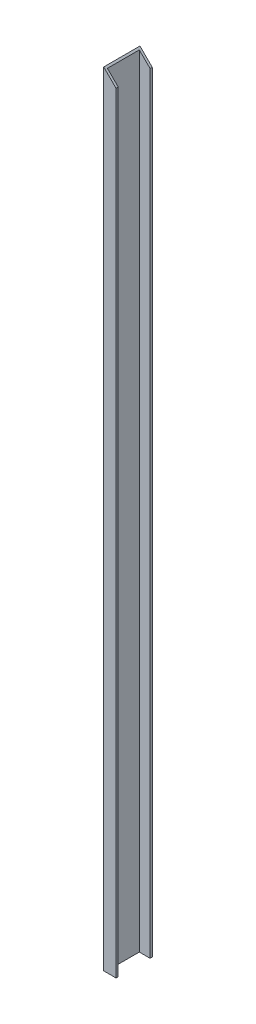
ISO-10303-21;
HEADER;
FILE_DESCRIPTION(('STEP AP214'),'2;1');
FILE_NAME('part.step','',(''),(''),'','','');
FILE_SCHEMA(('AUTOMOTIVE_DESIGN { 1 0 10303 214 1 1 1 1 }'));
ENDSEC;
DATA;
#1=APPLICATION_CONTEXT('core data for automotive mechanical design processes');
#2=APPLICATION_PROTOCOL_DEFINITION('international standard','automotive_design',2000,#1);
#3=PRODUCT_CONTEXT('',#1,'mechanical');
#4=PRODUCT('Part','Part','',(#3));
#5=PRODUCT_RELATED_PRODUCT_CATEGORY('part','',(#4));
#6=PRODUCT_DEFINITION_FORMATION('','',#4);
#7=PRODUCT_DEFINITION_CONTEXT('part definition',#1,'design');
#8=PRODUCT_DEFINITION('design','',#6,#7);
#9=PRODUCT_DEFINITION_SHAPE('','',#8);
#10=(LENGTH_UNIT() NAMED_UNIT(*) SI_UNIT(.MILLI.,.METRE.));
#11=(NAMED_UNIT(*) PLANE_ANGLE_UNIT() SI_UNIT($,.RADIAN.));
#12=(NAMED_UNIT(*) SI_UNIT($,.STERADIAN.) SOLID_ANGLE_UNIT());
#13=UNCERTAINTY_MEASURE_WITH_UNIT(LENGTH_MEASURE(1.E-05),#10,'distance_accuracy_value','');
#14=(GEOMETRIC_REPRESENTATION_CONTEXT(3) GLOBAL_UNCERTAINTY_ASSIGNED_CONTEXT((#13)) GLOBAL_UNIT_ASSIGNED_CONTEXT((#10,
#11,#12)) REPRESENTATION_CONTEXT('',''));
#15=CARTESIAN_POINT('',(0.,0.,0.));
#16=DIRECTION('',(0.,0.,1.));
#17=DIRECTION('',(1.,0.,0.));
#18=AXIS2_PLACEMENT_3D('',#15,#16,#17);
#19=CARTESIAN_POINT('',(0.,2743.2,-127.));
#20=DIRECTION('',(1.,0.,0.));
#21=DIRECTION('',(0.,0.,-1.));
#22=AXIS2_PLACEMENT_3D('',#19,#20,#21);
#23=PLANE('',#22);
#24=DIRECTION('',(0.,0.,1.));
#25=VECTOR('',#24,1.);
#26=CARTESIAN_POINT('',(0.,0.,-127.));
#27=LINE('',#26,#25);
#28=CARTESIAN_POINT('',(0.,0.,-127.));
#29=VERTEX_POINT('',#28);
#30=CARTESIAN_POINT('',(0.,0.,0.));
#31=VERTEX_POINT('',#30);
#32=EDGE_CURVE('E99',#29,#31,#27,.T.);
#33=ORIENTED_EDGE('',*,*,#32,.T.);
#34=DIRECTION('',(0.,-1.,0.));
#35=VECTOR('',#34,1.);
#36=CARTESIAN_POINT('',(0.,2743.2,0.));
#37=LINE('',#36,#35);
#38=CARTESIAN_POINT('',(0.,2743.2,0.));
#39=VERTEX_POINT('',#38);
#40=EDGE_CURVE('E11',#39,#31,#37,.T.);
#41=ORIENTED_EDGE('',*,*,#40,.F.);
#42=DIRECTION('',(0.,0.,1.));
#43=VECTOR('',#42,1.);
#44=CARTESIAN_POINT('',(0.,2743.2,-127.));
#45=LINE('',#44,#43);
#46=CARTESIAN_POINT('',(0.,2743.2,-127.));
#47=VERTEX_POINT('',#46);
#48=EDGE_CURVE('E100',#47,#39,#45,.T.);
#49=ORIENTED_EDGE('',*,*,#48,.F.);
#50=DIRECTION('',(0.,-1.,0.));
#51=VECTOR('',#50,1.);
#52=CARTESIAN_POINT('',(0.,2743.2,-127.));
#53=LINE('',#52,#51);
#54=EDGE_CURVE('E85',#47,#29,#53,.T.);
#55=ORIENTED_EDGE('',*,*,#54,.T.);
#56=EDGE_LOOP('',(#33,#41,#49,#55));
#57=FACE_BOUND('',#56,.T.);
#58=ADVANCED_FACE('F32',(#57),#23,.F.);
#59=CARTESIAN_POINT('',(0.,2743.2,0.));
#60=DIRECTION('',(0.,0.,-1.));
#61=DIRECTION('',(-1.,0.,0.));
#62=AXIS2_PLACEMENT_3D('',#59,#60,#61);
#63=PLANE('',#62);
#64=DIRECTION('',(0.,-1.,0.));
#65=VECTOR('',#64,1.);
#66=CARTESIAN_POINT('',(43.18,2743.2,0.));
#67=LINE('',#66,#65);
#68=CARTESIAN_POINT('',(43.18,2700.02,0.));
#69=VERTEX_POINT('',#68);
#70=CARTESIAN_POINT('',(43.18,0.,0.));
#71=VERTEX_POINT('',#70);
#72=EDGE_CURVE('E40',#69,#71,#67,.T.);
#73=ORIENTED_EDGE('',*,*,#72,.F.);
#74=DIRECTION('',(0.707106781186555,-0.70710678118654,0.));
#75=VECTOR('',#74,1.);
#76=CARTESIAN_POINT('',(0.,2743.2,0.));
#77=LINE('',#76,#75);
#78=EDGE_CURVE('E172',#39,#69,#77,.T.);
#79=ORIENTED_EDGE('',*,*,#78,.F.);
#80=ORIENTED_EDGE('',*,*,#40,.T.);
#81=DIRECTION('',(1.,0.,0.));
#82=VECTOR('',#81,1.);
#83=CARTESIAN_POINT('',(0.,0.,0.));
#84=LINE('',#83,#82);
#85=EDGE_CURVE('E127',#31,#71,#84,.T.);
#86=ORIENTED_EDGE('',*,*,#85,.T.);
#87=EDGE_LOOP('',(#73,#79,#80,#86));
#88=FACE_BOUND('',#87,.T.);
#89=ADVANCED_FACE('F128',(#88),#63,.F.);
#90=CARTESIAN_POINT('',(43.18,2743.2,0.));
#91=DIRECTION('',(-1.,0.,0.));
#92=DIRECTION('',(0.,0.,1.));
#93=AXIS2_PLACEMENT_3D('',#90,#91,#92);
#94=PLANE('',#93);
#95=DIRECTION('',(0.,-1.,0.));
#96=VECTOR('',#95,1.);
#97=CARTESIAN_POINT('',(43.18,2743.2,-7.62));
#98=LINE('',#97,#96);
#99=CARTESIAN_POINT('',(43.18,2700.02,-7.62));
#100=VERTEX_POINT('',#99);
#101=CARTESIAN_POINT('',(43.18,0.,-7.62));
#102=VERTEX_POINT('',#101);
#103=EDGE_CURVE('E111',#100,#102,#98,.T.);
#104=ORIENTED_EDGE('',*,*,#103,.F.);
#105=DIRECTION('',(0.,0.,1.));
#106=VECTOR('',#105,1.);
#107=CARTESIAN_POINT('',(43.18,2700.02,-127.));
#108=LINE('',#107,#106);
#109=EDGE_CURVE('E124',#100,#69,#108,.T.);
#110=ORIENTED_EDGE('',*,*,#109,.T.);
#111=ORIENTED_EDGE('',*,*,#72,.T.);
#112=DIRECTION('',(0.,0.,-1.));
#113=VECTOR('',#112,1.);
#114=CARTESIAN_POINT('',(43.18,0.,0.));
#115=LINE('',#114,#113);
#116=EDGE_CURVE('E120',#71,#102,#115,.T.);
#117=ORIENTED_EDGE('',*,*,#116,.T.);
#118=EDGE_LOOP('',(#104,#110,#111,#117));
#119=FACE_BOUND('',#118,.T.);
#120=ADVANCED_FACE('F118',(#119),#94,.F.);
#121=CARTESIAN_POINT('',(43.18,2743.2,-7.62));
#122=DIRECTION('',(0.,0.,1.));
#123=DIRECTION('',(1.,0.,0.));
#124=AXIS2_PLACEMENT_3D('',#121,#122,#123);
#125=PLANE('',#124);
#126=DIRECTION('',(0.,-1.,0.));
#127=VECTOR('',#126,1.);
#128=CARTESIAN_POINT('',(5.33041385719985,2743.2,-7.61999999999999));
#129=LINE('',#128,#127);
#130=CARTESIAN_POINT('',(5.33041385719985,2737.8695861428,-7.61999999999999));
#131=VERTEX_POINT('',#130);
#132=CARTESIAN_POINT('',(5.33041385719985,0.,-7.61999999999999));
#133=VERTEX_POINT('',#132);
#134=EDGE_CURVE('E109',#131,#133,#129,.T.);
#135=ORIENTED_EDGE('',*,*,#134,.F.);
#136=DIRECTION('',(0.707106781186555,-0.70710678118654,0.));
#137=VECTOR('',#136,1.);
#138=CARTESIAN_POINT('',(21.5900000000004,2721.61,-7.62));
#139=LINE('',#138,#137);
#140=EDGE_CURVE('E157',#131,#100,#139,.T.);
#141=ORIENTED_EDGE('',*,*,#140,.T.);
#142=ORIENTED_EDGE('',*,*,#103,.T.);
#143=DIRECTION('',(-1.,0.,0.));
#144=VECTOR('',#143,1.);
#145=CARTESIAN_POINT('',(43.18,0.,-7.62));
#146=LINE('',#145,#144);
#147=EDGE_CURVE('E133',#102,#133,#146,.T.);
#148=ORIENTED_EDGE('',*,*,#147,.T.);
#149=EDGE_LOOP('',(#135,#141,#142,#148));
#150=FACE_BOUND('',#149,.T.);
#151=ADVANCED_FACE('F154',(#150),#125,.F.);
#152=CARTESIAN_POINT('',(5.33041385719985,2743.2,-7.61999999999999));
#153=DIRECTION('',(-1.,0.,0.));
#154=DIRECTION('',(0.,0.,1.));
#155=AXIS2_PLACEMENT_3D('',#152,#153,#154);
#156=PLANE('',#155);
#157=DIRECTION('',(0.,-1.,0.));
#158=VECTOR('',#157,1.);
#159=CARTESIAN_POINT('',(5.33041385719985,2743.2,-119.38));
#160=LINE('',#159,#158);
#161=CARTESIAN_POINT('',(5.33041385719985,2737.8695861428,-119.38));
#162=VERTEX_POINT('',#161);
#163=CARTESIAN_POINT('',(5.33041385719985,0.,-119.38));
#164=VERTEX_POINT('',#163);
#165=EDGE_CURVE('E107',#162,#164,#160,.T.);
#166=ORIENTED_EDGE('',*,*,#165,.F.);
#167=DIRECTION('',(0.,0.,1.));
#168=VECTOR('',#167,1.);
#169=CARTESIAN_POINT('',(5.33041385719985,2737.8695861428,-7.61999999999999));
#170=LINE('',#169,#168);
#171=EDGE_CURVE('E151',#162,#131,#170,.T.);
#172=ORIENTED_EDGE('',*,*,#171,.T.);
#173=ORIENTED_EDGE('',*,*,#134,.T.);
#174=DIRECTION('',(0.,0.,-1.));
#175=VECTOR('',#174,1.);
#176=CARTESIAN_POINT('',(5.33041385719985,0.,-7.61999999999999));
#177=LINE('',#176,#175);
#178=EDGE_CURVE('E135',#133,#164,#177,.T.);
#179=ORIENTED_EDGE('',*,*,#178,.T.);
#180=EDGE_LOOP('',(#166,#172,#173,#179));
#181=FACE_BOUND('',#180,.T.);
#182=ADVANCED_FACE('F146',(#181),#156,.F.);
#183=CARTESIAN_POINT('',(5.33041385719985,2743.2,-119.38));
#184=DIRECTION('',(0.,0.,-1.));
#185=DIRECTION('',(-1.,0.,0.));
#186=AXIS2_PLACEMENT_3D('',#183,#184,#185);
#187=PLANE('',#186);
#188=DIRECTION('',(0.,-1.,0.));
#189=VECTOR('',#188,1.);
#190=CARTESIAN_POINT('',(43.18,2743.2,-119.38));
#191=LINE('',#190,#189);
#192=CARTESIAN_POINT('',(43.18,2700.02,-119.38));
#193=VERTEX_POINT('',#192);
#194=CARTESIAN_POINT('',(43.18,0.,-119.38));
#195=VERTEX_POINT('',#194);
#196=EDGE_CURVE('E84',#193,#195,#191,.T.);
#197=ORIENTED_EDGE('',*,*,#196,.F.);
#198=DIRECTION('',(-0.707106781186555,0.70710678118654,0.));
#199=VECTOR('',#198,1.);
#200=CARTESIAN_POINT('',(2.66520692859998,2740.5347930714,-119.38));
#201=LINE('',#200,#199);
#202=EDGE_CURVE('E168',#193,#162,#201,.T.);
#203=ORIENTED_EDGE('',*,*,#202,.T.);
#204=ORIENTED_EDGE('',*,*,#165,.T.);
#205=DIRECTION('',(1.,0.,0.));
#206=VECTOR('',#205,1.);
#207=CARTESIAN_POINT('',(5.33041385719985,0.,-119.38));
#208=LINE('',#207,#206);
#209=EDGE_CURVE('E94',#164,#195,#208,.T.);
#210=ORIENTED_EDGE('',*,*,#209,.T.);
#211=EDGE_LOOP('',(#197,#203,#204,#210));
#212=FACE_BOUND('',#211,.T.);
#213=ADVANCED_FACE('F141',(#212),#187,.F.);
#214=CARTESIAN_POINT('',(43.18,2743.2,-119.38));
#215=DIRECTION('',(-1.,0.,0.));
#216=DIRECTION('',(0.,0.,1.));
#217=AXIS2_PLACEMENT_3D('',#214,#215,#216);
#218=PLANE('',#217);
#219=DIRECTION('',(0.,-1.,0.));
#220=VECTOR('',#219,1.);
#221=CARTESIAN_POINT('',(43.18,2743.2,-127.));
#222=LINE('',#221,#220);
#223=CARTESIAN_POINT('',(43.18,2700.02,-127.));
#224=VERTEX_POINT('',#223);
#225=CARTESIAN_POINT('',(43.18,0.,-127.));
#226=VERTEX_POINT('',#225);
#227=EDGE_CURVE('E75',#224,#226,#222,.T.);
#228=ORIENTED_EDGE('',*,*,#227,.F.);
#229=EDGE_CURVE('E166',#224,#193,#108,.T.);
#230=ORIENTED_EDGE('',*,*,#229,.T.);
#231=ORIENTED_EDGE('',*,*,#196,.T.);
#232=DIRECTION('',(0.,0.,-1.));
#233=VECTOR('',#232,1.);
#234=CARTESIAN_POINT('',(43.18,0.,-119.38));
#235=LINE('',#234,#233);
#236=EDGE_CURVE('E88',#195,#226,#235,.T.);
#237=ORIENTED_EDGE('',*,*,#236,.T.);
#238=EDGE_LOOP('',(#228,#230,#231,#237));
#239=FACE_BOUND('',#238,.T.);
#240=ADVANCED_FACE('F89',(#239),#218,.F.);
#241=CARTESIAN_POINT('',(43.18,2743.2,-127.));
#242=DIRECTION('',(0.,0.,1.));
#243=DIRECTION('',(1.,0.,0.));
#244=AXIS2_PLACEMENT_3D('',#241,#242,#243);
#245=PLANE('',#244);
#246=ORIENTED_EDGE('',*,*,#54,.F.);
#247=DIRECTION('',(0.707106781186555,-0.70710678118654,0.));
#248=VECTOR('',#247,1.);
#249=CARTESIAN_POINT('',(0.,2743.2,-127.));
#250=LINE('',#249,#248);
#251=EDGE_CURVE('E47',#47,#224,#250,.T.);
#252=ORIENTED_EDGE('',*,*,#251,.T.);
#253=ORIENTED_EDGE('',*,*,#227,.T.);
#254=DIRECTION('',(-1.,0.,0.));
#255=VECTOR('',#254,1.);
#256=CARTESIAN_POINT('',(43.18,0.,-127.));
#257=LINE('',#256,#255);
#258=EDGE_CURVE('E79',#226,#29,#257,.T.);
#259=ORIENTED_EDGE('',*,*,#258,.T.);
#260=EDGE_LOOP('',(#246,#252,#253,#259));
#261=FACE_BOUND('',#260,.T.);
#262=ADVANCED_FACE('F77',(#261),#245,.F.);
#263=CARTESIAN_POINT('',(0.,0.,0.));
#264=DIRECTION('',(0.,1.,0.));
#265=DIRECTION('',(0.,0.,1.));
#266=AXIS2_PLACEMENT_3D('',#263,#264,#265);
#267=PLANE('',#266);
#268=ORIENTED_EDGE('',*,*,#32,.F.);
#269=ORIENTED_EDGE('',*,*,#258,.F.);
#270=ORIENTED_EDGE('',*,*,#236,.F.);
#271=ORIENTED_EDGE('',*,*,#209,.F.);
#272=ORIENTED_EDGE('',*,*,#178,.F.);
#273=ORIENTED_EDGE('',*,*,#147,.F.);
#274=ORIENTED_EDGE('',*,*,#116,.F.);
#275=ORIENTED_EDGE('',*,*,#85,.F.);
#276=EDGE_LOOP('',(#268,#269,#270,#271,#272,#273,#274,#275));
#277=FACE_BOUND('',#276,.T.);
#278=ADVANCED_FACE('F97',(#277),#267,.F.);
#279=CARTESIAN_POINT('',(0.,2743.2,-127.));
#280=DIRECTION('',(-0.70710678118654,-0.707106781186555,0.));
#281=DIRECTION('',(0.707106781186555,-0.70710678118654,0.));
#282=AXIS2_PLACEMENT_3D('',#279,#280,#281);
#283=PLANE('',#282);
#284=ORIENTED_EDGE('',*,*,#171,.F.);
#285=ORIENTED_EDGE('',*,*,#202,.F.);
#286=ORIENTED_EDGE('',*,*,#229,.F.);
#287=ORIENTED_EDGE('',*,*,#251,.F.);
#288=ORIENTED_EDGE('',*,*,#48,.T.);
#289=ORIENTED_EDGE('',*,*,#78,.T.);
#290=ORIENTED_EDGE('',*,*,#109,.F.);
#291=ORIENTED_EDGE('',*,*,#140,.F.);
#292=EDGE_LOOP('',(#284,#285,#286,#287,#288,#289,#290,#291));
#293=FACE_BOUND('',#292,.T.);
#294=ADVANCED_FACE('F167',(#293),#283,.F.);
#295=CLOSED_SHELL('',(#58,#89,#120,#151,#182,#213,#240,#262,#278,#294));
#296=MANIFOLD_SOLID_BREP('B2',#295);
#297=ADVANCED_BREP_SHAPE_REPRESENTATION('',(#18,#296),#14);
#298=SHAPE_DEFINITION_REPRESENTATION(#9,#297);
ENDSEC;
END-ISO-10303-21;
